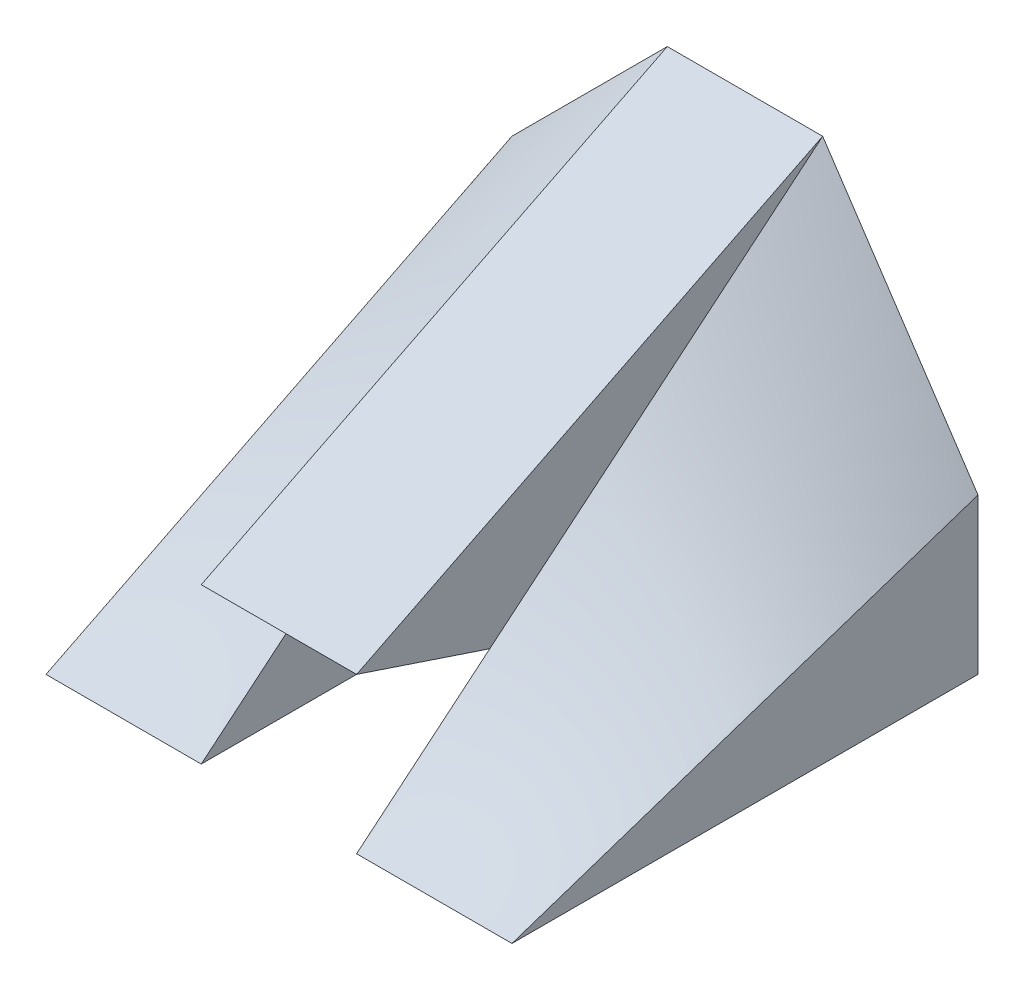
ISO-10303-21;
HEADER;
FILE_DESCRIPTION(('STEP AP214'),'2;1');
FILE_NAME('part.step','',(''),(''),'','','');
FILE_SCHEMA(('AUTOMOTIVE_DESIGN { 1 0 10303 214 1 1 1 1 }'));
ENDSEC;
DATA;
#1=APPLICATION_CONTEXT('core data for automotive mechanical design processes');
#2=APPLICATION_PROTOCOL_DEFINITION('international standard','automotive_design',2000,#1);
#3=PRODUCT_CONTEXT('',#1,'mechanical');
#4=PRODUCT('Part','Part','',(#3));
#5=PRODUCT_RELATED_PRODUCT_CATEGORY('part','',(#4));
#6=PRODUCT_DEFINITION_FORMATION('','',#4);
#7=PRODUCT_DEFINITION_CONTEXT('part definition',#1,'design');
#8=PRODUCT_DEFINITION('design','',#6,#7);
#9=PRODUCT_DEFINITION_SHAPE('','',#8);
#10=(LENGTH_UNIT() NAMED_UNIT(*) SI_UNIT(.MILLI.,.METRE.));
#11=(NAMED_UNIT(*) PLANE_ANGLE_UNIT() SI_UNIT($,.RADIAN.));
#12=(NAMED_UNIT(*) SI_UNIT($,.STERADIAN.) SOLID_ANGLE_UNIT());
#13=UNCERTAINTY_MEASURE_WITH_UNIT(LENGTH_MEASURE(1.E-05),#10,'distance_accuracy_value','');
#14=(GEOMETRIC_REPRESENTATION_CONTEXT(3) GLOBAL_UNCERTAINTY_ASSIGNED_CONTEXT((#13)) GLOBAL_UNIT_ASSIGNED_CONTEXT((#10,
#11,#12)) REPRESENTATION_CONTEXT('',''));
#15=CARTESIAN_POINT('',(0.,0.,0.));
#16=DIRECTION('',(0.,0.,1.));
#17=DIRECTION('',(1.,0.,0.));
#18=AXIS2_PLACEMENT_3D('',#15,#16,#17);
#19=CARTESIAN_POINT('',(0.,0.,0.));
#20=DIRECTION('',(0.,-1.,0.));
#21=DIRECTION('',(0.,0.,-1.));
#22=AXIS2_PLACEMENT_3D('',#19,#20,#21);
#23=PLANE('',#22);
#24=DIRECTION('',(-1.,0.,0.));
#25=VECTOR('',#24,1.);
#26=CARTESIAN_POINT('',(-3.,0.,-3.));
#27=LINE('',#26,#25);
#28=CARTESIAN_POINT('',(-1.,0.,-3.));
#29=VERTEX_POINT('',#28);
#30=CARTESIAN_POINT('',(-3.,0.,-3.));
#31=VERTEX_POINT('',#30);
#32=EDGE_CURVE('E432',#29,#31,#27,.T.);
#33=ORIENTED_EDGE('',*,*,#32,.F.);
#34=DIRECTION('',(0.,0.,-1.));
#35=VECTOR('',#34,1.);
#36=CARTESIAN_POINT('',(-1.,0.,0.));
#37=LINE('',#36,#35);
#38=CARTESIAN_POINT('',(-1.00001660641781,0.000133120669290547,3.00002214179858));
#39=VERTEX_POINT('',#38);
#40=EDGE_CURVE('E425',#39,#29,#37,.T.);
#41=ORIENTED_EDGE('',*,*,#40,.F.);
#42=CARTESIAN_POINT('',(-2.83252834775677,0.,3.));
#43=CARTESIAN_POINT('',(-2.75626208832465,0.000252161228264777,3.00016810748551));
#44=CARTESIAN_POINT('',(-2.67999555428753,0.000422557115129773,3.00028170474342));
#45=CARTESIAN_POINT('',(-2.52740270307202,0.000643858596205159,3.00042923906414));
#46=CARTESIAN_POINT('',(-2.45107638568512,0.00069467084027668,3.00046311389352));
#47=CARTESIAN_POINT('',(-2.29838560706298,0.000720595556677307,3.00048039703779));
#48=CARTESIAN_POINT('',(-2.22202114583537,0.000695670170424793,3.00046378011362));
#49=CARTESIAN_POINT('',(-2.06927384890658,0.000610254274458775,3.00040683618298));
#50=CARTESIAN_POINT('',(-1.99289101321343,0.000549755193183134,3.00036650346213));
#51=CARTESIAN_POINT('',(-1.84012317189813,0.000426265169038458,3.00028417677936));
#52=CARTESIAN_POINT('',(-1.7637381662761,0.000363274155287285,3.0002421827702));
#53=CARTESIAN_POINT('',(-1.61097685897787,0.000256806717233708,3.00017120447816));
#54=CARTESIAN_POINT('',(-1.53460055730421,0.000213328064371145,3.00014221870959));
#55=CARTESIAN_POINT('',(-1.38186052990116,0.000155320529237206,3.0001035470195));
#56=CARTESIAN_POINT('',(-1.30549680417419,0.000140786875787756,3.0000938579172));
#57=CARTESIAN_POINT('',(-1.15277716574798,0.000127346541916565,3.00008489769462));
#58=CARTESIAN_POINT('',(-1.07642125304902,0.000128438262258694,3.00008562550818));
#59=CARTESIAN_POINT('',(-1.00006534503616,0.000130688988310663,3.00008712599221));
#60=B_SPLINE_CURVE_WITH_KNOTS('',3,(#42,#43,#44,#45,#46,#47,#48,#49,#50,#51,#52,#53,#54,#55,#56,
#57,#58,#59),.UNSPECIFIED.,.F.,.F.,(4,2,2,2,2,2,2,2,4),(0.,0.228800358352873,0.457779265129282,
0.686872649245776,0.916021256563631,1.14517638662587,1.37430533758835,1.60339651672287,
1.83246424884899),.UNSPECIFIED.);
#61=CARTESIAN_POINT('',(-2.83252834775677,0.,3.));
#62=VERTEX_POINT('',#61);
#63=EDGE_CURVE('E92',#62,#39,#60,.T.);
#64=ORIENTED_EDGE('',*,*,#63,.F.);
#65=CARTESIAN_POINT('',(-2.99965424200545,-0.000691515989107811,2.9995389893406));
#66=CARTESIAN_POINT('',(-2.99269332261338,-0.00065659485866898,2.99956227009422));
#67=CARTESIAN_POINT('',(-2.98573239739642,-0.000622479066639647,2.99958501395558));
#68=CARTESIAN_POINT('',(-2.97180975850071,-0.000555824233670172,2.99962945051089));
#69=CARTESIAN_POINT('',(-2.96484804482073,-0.000523285369277587,2.99965114308715));
#70=CARTESIAN_POINT('',(-2.95092384386102,-0.000459754770680128,2.99969349681955));
#71=CARTESIAN_POINT('',(-2.94396135658016,-0.000428763206516596,2.99971415786232));
#72=CARTESIAN_POINT('',(-2.93003562348889,-0.000368297042639115,2.99975446863824));
#73=CARTESIAN_POINT('',(-2.92307237767745,-0.000338822606472967,2.99977411826236));
#74=CARTESIAN_POINT('',(-2.90914514279987,-0.000281360159494392,2.99981242656034));
#75=CARTESIAN_POINT('',(-2.90218115373281,-0.000253372305776147,2.99983108512948));
#76=CARTESIAN_POINT('',(-2.88825244780772,-0.000198852091333291,2.99986743193911));
#77=CARTESIAN_POINT('',(-2.88128773094885,-0.000172319881295047,2.99988512007914));
#78=CARTESIAN_POINT('',(-2.8673575850832,-0.000120679689118446,2.99991954687393));
#79=CARTESIAN_POINT('',(-2.86039215607564,-9.5571851318476E-05,2.99993628543246));
#80=CARTESIAN_POINT('',(-2.84646060171308,-4.67487354780505E-05,2.99996883417635));
#81=CARTESIAN_POINT('',(-2.83949447635738,-2.30335954882306E-05,2.99998464426968));
#82=CARTESIAN_POINT('',(-2.83252834775677,0.,3.));
#83=B_SPLINE_CURVE_WITH_KNOTS('',3,(#65,#66,#67,#68,#69,#70,#71,#72,#73,#74,#75,#76,#77,#78,#79,
#80,#81,#82),.UNSPECIFIED.,.F.,.F.,(4,2,2,2,2,2,2,2,4),(0.,0.0208831376683841,
0.0417686079674516,0.0626563684563951,0.083546375969528,0.104438586654167,0.125332956008622,
0.146229438920243,0.167127989703535),.UNSPECIFIED.);
#84=CARTESIAN_POINT('',(-2.99991102533979,-0.000177949320414793,2.99898778072392));
#85=VERTEX_POINT('',#84);
#86=EDGE_CURVE('E197',#85,#62,#83,.T.);
#87=ORIENTED_EDGE('',*,*,#86,.F.);
#88=DIRECTION('',(0.,0.,1.));
#89=VECTOR('',#88,1.);
#90=CARTESIAN_POINT('',(-3.,0.,3.));
#91=LINE('',#90,#89);
#92=EDGE_CURVE('E198',#31,#85,#91,.T.);
#93=ORIENTED_EDGE('',*,*,#92,.F.);
#94=EDGE_LOOP('',(#33,#41,#64,#87,#93));
#95=FACE_BOUND('',#94,.T.);
#96=ADVANCED_FACE('F51',(#95),#23,.T.);
#97=CARTESIAN_POINT('',(3.,5.,3.));
#98=DIRECTION('',(-1.,0.,0.));
#99=DIRECTION('',(0.,0.,1.));
#100=AXIS2_PLACEMENT_3D('',#97,#98,#99);
#101=PLANE('',#100);
#102=DIRECTION('',(0.,-1.,0.));
#103=VECTOR('',#102,1.);
#104=CARTESIAN_POINT('',(3.,5.,-3.));
#105=LINE('',#104,#103);
#106=CARTESIAN_POINT('',(3.,2.00039813631355,-3.));
#107=VERTEX_POINT('',#106);
#108=CARTESIAN_POINT('',(3.,0.,-3.));
#109=VERTEX_POINT('',#108);
#110=EDGE_CURVE('E12',#107,#109,#105,.T.);
#111=ORIENTED_EDGE('',*,*,#110,.F.);
#112=CARTESIAN_POINT('',(2.99949686879704,-0.000670841603944508,2.99960867573104));
#113=CARTESIAN_POINT('',(3.00010084139898,0.0835000211606389,2.74998173431321));
#114=CARTESIAN_POINT('',(3.00030915949056,0.167103942046916,2.50016526920305));
#115=CARTESIAN_POINT('',(3.00036652618134,0.333832763962334,2.0002528887572));
#116=CARTESIAN_POINT('',(3.00021542038893,0.416957443758085,1.75015689947287));
#117=CARTESIAN_POINT('',(2.99998620313517,0.583310919385398,1.25000132348962));
#118=CARTESIAN_POINT('',(2.99990809126368,0.666539714629319,0.999941736594054));
#119=CARTESIAN_POINT('',(2.99984749666387,0.833126337773783,0.499892359628227));
#120=CARTESIAN_POINT('',(2.99986500468197,0.916484152408026,0.249902565145329));
#121=CARTESIAN_POINT('',(2.99992780060308,1.08323695493404,-0.250055817476298));
#122=CARTESIAN_POINT('',(2.99997308762834,1.16663194156808,-0.500024406035495));
#123=CARTESIAN_POINT('',(3.0000150378546,1.33335583434716,-0.999995655513934));
#124=CARTESIAN_POINT('',(3.00001169894991,1.41668473747427,-1.24999831743989));
#125=CARTESIAN_POINT('',(2.99995510870599,1.5832728760559,-1.75003310879462));
#126=CARTESIAN_POINT('',(2.99990185624671,1.66653210990509,-2.00006523875875));
#127=CARTESIAN_POINT('',(2.9999314871799,1.83323209580157,-2.50002362643407));
#128=CARTESIAN_POINT('',(3.00001434838104,1.91667281604529,-2.7499498947598));
#129=CARTESIAN_POINT('',(3.00025823719015,2.00034431625353,-2.99979914885211));
#130=B_SPLINE_CURVE_WITH_KNOTS('',3,(#112,#113,#114,#115,#116,#117,#118,#119,#120,#121,#122,
#123,#124,#125,#126,#127,#128,#129),.UNSPECIFIED.,.F.,.F.,(4,2,2,2,2,2,2,2,4),(0.,
0.790304946466063,1.58094943209917,2.37158947517746,3.16215300573728,3.9526915580468,
4.74326434372514,5.53385487027832,6.32431651546668),.UNSPECIFIED.);
#131=CARTESIAN_POINT('',(2.99987421719926,-0.000167710400986034,2.99930478184289));
#132=VERTEX_POINT('',#131);
#133=EDGE_CURVE('E158',#107,#132,#130,.F.);
#134=ORIENTED_EDGE('',*,*,#133,.T.);
#135=DIRECTION('',(0.,0.,-1.));
#136=VECTOR('',#135,1.);
#137=CARTESIAN_POINT('',(3.,0.,3.));
#138=LINE('',#137,#136);
#139=EDGE_CURVE('E182',#132,#109,#138,.T.);
#140=ORIENTED_EDGE('',*,*,#139,.T.);
#141=EDGE_LOOP('',(#111,#134,#140));
#142=FACE_BOUND('',#141,.T.);
#143=ADVANCED_FACE('F53',(#142),#101,.F.);
#144=CARTESIAN_POINT('',(-3.,5.,-3.));
#145=DIRECTION('',(0.,0.,1.));
#146=DIRECTION('',(1.,0.,0.));
#147=AXIS2_PLACEMENT_3D('',#144,#145,#146);
#148=PLANE('',#147);
#149=DIRECTION('',(1.,0.,0.));
#150=VECTOR('',#149,1.);
#151=CARTESIAN_POINT('',(-1.,5.,-3.));
#152=LINE('',#151,#150);
#153=CARTESIAN_POINT('',(-1.00000045709793,5.00000091419586,-2.9999993905361));
#154=VERTEX_POINT('',#153);
#155=CARTESIAN_POINT('',(0.999905739950611,5.,-3.00017009046385));
#156=VERTEX_POINT('',#155);
#157=EDGE_CURVE('E171',#154,#156,#152,.T.);
#158=ORIENTED_EDGE('',*,*,#157,.T.);
#159=CARTESIAN_POINT('',(3.00025823719015,2.00034431625353,-2.99979914885211));
#160=CARTESIAN_POINT('',(2.9165815343091,2.12500950582586,-3.00003244505779));
#161=CARTESIAN_POINT('',(2.8331245400502,2.24982154317101,-3.00013496185396));
#162=CARTESIAN_POINT('',(2.6663872700847,2.49968129762726,-3.00020253257725));
#163=CARTESIAN_POINT('',(2.58310714493294,2.62472911530675,-3.0001674969042));
#164=CARTESIAN_POINT('',(2.41655849866416,2.87485598742635,-3.0000840726291));
#165=CARTESIAN_POINT('',(2.33328998049428,2.99993504381261,-3.00003568227929));
#166=CARTESIAN_POINT('',(2.1667171902848,3.25005273534464,-2.99996471978813));
#167=CARTESIAN_POINT('',(2.0834129222521,3.37509137315484,-2.99994214526546));
#168=CARTESIAN_POINT('',(1.91676891665385,3.62512523974865,-2.99992351752527));
#169=CARTESIAN_POINT('',(1.83342918396722,3.75012047178516,-2.99992746140581));
#170=CARTESIAN_POINT('',(1.6667419817785,4.00009936226447,-2.9999417119794));
#171=CARTESIAN_POINT('',(1.58339451265636,4.12508302096064,-2.99995201844643));
#172=CARTESIAN_POINT('',(1.4167112859051,4.3750584961942,-2.99996556959362));
#173=CARTESIAN_POINT('',(1.33337552829874,4.50005031274676,-2.99996881426025));
#174=CARTESIAN_POINT('',(1.16667899081956,4.75000058621244,-2.99999476442776));
#175=CARTESIAN_POINT('',(1.0833182139662,4.87495904513981,-3.00001746813241));
#176=CARTESIAN_POINT('',(0.999918795167255,4.99989172688968,-3.00006315931436));
#177=B_SPLINE_CURVE_WITH_KNOTS('',3,(#159,#160,#161,#162,#163,#164,#165,#166,#167,#168,#169,
#170,#171,#172,#173,#174,#175,#176),.UNSPECIFIED.,.F.,.F.,(4,2,2,2,2,2,2,2,4),(0.,
0.450431095663525,0.901155645919849,1.35193921195104,1.80268119325227,2.25337385039558,
2.70405049890196,3.15472801094315,3.60536392622476),.UNSPECIFIED.);
#178=EDGE_CURVE('E151',#156,#107,#177,.F.);
#179=ORIENTED_EDGE('',*,*,#178,.T.);
#180=ORIENTED_EDGE('',*,*,#110,.T.);
#181=CARTESIAN_POINT('',(1.,0.,-3.));
#182=VERTEX_POINT('',#181);
#183=EDGE_CURVE('E203',#109,#182,#27,.T.);
#184=ORIENTED_EDGE('',*,*,#183,.T.);
#185=DIRECTION('',(1.,0.,0.));
#186=VECTOR('',#185,1.);
#187=CARTESIAN_POINT('',(-1.,0.,-3.));
#188=LINE('',#187,#186);
#189=EDGE_CURVE('E175',#29,#182,#188,.T.);
#190=ORIENTED_EDGE('',*,*,#189,.F.);
#191=ORIENTED_EDGE('',*,*,#32,.T.);
#192=DIRECTION('',(0.,-1.,0.));
#193=VECTOR('',#192,1.);
#194=CARTESIAN_POINT('',(-3.,5.,-3.));
#195=LINE('',#194,#193);
#196=CARTESIAN_POINT('',(-3.,3.00064485905729,-3.));
#197=VERTEX_POINT('',#196);
#198=EDGE_CURVE('E63',#197,#31,#195,.T.);
#199=ORIENTED_EDGE('',*,*,#198,.F.);
#200=CARTESIAN_POINT('',(-1.00000114274482,5.00000228548965,-2.99999847634025));
#201=CARTESIAN_POINT('',(-1.08338845189845,4.91675269914589,-2.99993726620253));
#202=CARTESIAN_POINT('',(-1.16675115447005,4.83347845242652,-2.99989795249043));
#203=CARTESIAN_POINT('',(-1.33344518739327,4.66686720589872,-2.99986115853691));
#204=CARTESIAN_POINT('',(-1.41677650889303,4.58353019723219,-2.99986368616658));
#205=CARTESIAN_POINT('',(-1.58340858460542,4.4167969732732,-2.99990864094285));
#206=CARTESIAN_POINT('',(-1.66670933109036,4.33340075026015,-2.99995107495534));
#207=CARTESIAN_POINT('',(-1.83328933596971,4.16656749120476,-3.00006363236691));
#208=CARTESIAN_POINT('',(-1.91656859073512,4.08313045154217,-3.00013375898788));
#209=CARTESIAN_POINT('',(-2.08312301222705,3.91625136587081,-3.00027805417874));
#210=CARTESIAN_POINT('',(-2.16639817892828,3.83280931983681,-3.00035222277108));
#211=CARTESIAN_POINT('',(-2.33297476227846,3.66598107573997,-3.00046407199182));
#212=CARTESIAN_POINT('',(-2.41627617161399,3.58259487037883,-3.00050175911431));
#213=CARTESIAN_POINT('',(-2.5829487300113,3.41596628331295,-3.00048221630034));
#214=CARTESIAN_POINT('',(-2.66631983149623,3.33272385409654,-3.00042502862544));
#215=CARTESIAN_POINT('',(-2.83319597199074,3.16650667575041,-3.0001321565595));
#216=CARTESIAN_POINT('',(-2.91670085171446,3.08353176636899,-2.99989661418514));
#217=CARTESIAN_POINT('',(-3.0003524108194,3.00070482163879,-2.99953011890747));
#218=B_SPLINE_CURVE_WITH_KNOTS('',3,(#200,#201,#202,#203,#204,#205,#206,#207,#208,#209,#210,
#211,#212,#213,#214,#215,#216,#217),.UNSPECIFIED.,.F.,.F.,(4,2,2,2,2,2,2,2,4),(0.,
0.353490394854379,0.707047288165293,1.0606650221383,1.41432390977513,1.76798476170235,
2.12158264664126,2.47502306524455,2.82818234898998),.UNSPECIFIED.);
#219=EDGE_CURVE('E179',#154,#197,#218,.T.);
#220=ORIENTED_EDGE('',*,*,#219,.F.);
#221=EDGE_LOOP('',(#158,#179,#180,#184,#190,#191,#199,#220));
#222=FACE_BOUND('',#221,.T.);
#223=ADVANCED_FACE('F178',(#222),#148,.F.);
#224=CARTESIAN_POINT('',(-3.,5.,3.));
#225=DIRECTION('',(1.,0.,0.));
#226=DIRECTION('',(0.,0.,-1.));
#227=AXIS2_PLACEMENT_3D('',#224,#225,#226);
#228=PLANE('',#227);
#229=ORIENTED_EDGE('',*,*,#92,.T.);
#230=CARTESIAN_POINT('',(-3.0003524108194,3.00070482163879,-2.99953011890747));
#231=CARTESIAN_POINT('',(-3.00011826196853,2.87522268396966,-2.74981463744052));
#232=CARTESIAN_POINT('',(-3.00001029525953,2.75000963336516,-2.49996435867952));
#233=CARTESIAN_POINT('',(-2.99991614385439,2.49982709521279,-2.00010142320219));
#234=CARTESIAN_POINT('',(-2.99992997489533,2.37485764122577,-1.75008874967646));
#235=CARTESIAN_POINT('',(-2.99994882986483,2.12489826708271,-1.25006944155302));
#236=CARTESIAN_POINT('',(-2.99995385367352,1.99990834667128,-1.0000628070838));
#237=CARTESIAN_POINT('',(-2.9999538752773,1.74990794211043,-0.50006188274196));
#238=CARTESIAN_POINT('',(-2.99994887313902,1.62489745810321,-0.250067592798324));
#239=CARTESIAN_POINT('',(-2.99995039565112,1.37489976955842,0.249935904355791));
#240=CARTESIAN_POINT('',(-2.99995692042229,1.24991256527852,0.499945111695139));
#241=CARTESIAN_POINT('',(-2.99999281832588,0.99998477075985,0.999992156218313));
#242=CARTESIAN_POINT('',(-3.00002219184974,0.875044181356342,1.25002999381924));
#243=CARTESIAN_POINT('',(-3.00007425613638,0.62515178685525,1.75009245901683));
#244=CARTESIAN_POINT('',(-3.00009694706339,0.500199982108799,2.00011708678713));
#245=CARTESIAN_POINT('',(-3.00000810694073,0.250027924926271,2.49998738716467));
#246=CARTESIAN_POINT('',(-2.99989659500183,0.124807713246414,2.7498330801836));
#247=CARTESIAN_POINT('',(-2.99965424200545,-0.000691515989107036,2.9995389893406));
#248=B_SPLINE_CURVE_WITH_KNOTS('',3,(#230,#231,#232,#233,#234,#235,#236,#237,#238,#239,#240,
#241,#242,#243,#244,#245,#246,#247),.UNSPECIFIED.,.F.,.F.,(4,2,2,2,2,2,2,2,4),(0.,
0.838410062262009,1.67692845425153,2.51545825843106,3.35398248889736,4.19251550657209,
5.031062889859,5.86958966336629,6.70799704300412),.UNSPECIFIED.);
#249=EDGE_CURVE('E535',#197,#85,#248,.T.);
#250=ORIENTED_EDGE('',*,*,#249,.F.);
#251=ORIENTED_EDGE('',*,*,#198,.T.);
#252=EDGE_LOOP('',(#229,#250,#251));
#253=FACE_BOUND('',#252,.T.);
#254=ADVANCED_FACE('F225',(#253),#228,.F.);
#255=CARTESIAN_POINT('',(2.87364055055317,-1.30086473006368E-13,2.99999999999992));
#256=CARTESIAN_POINT('',(2.87891027117043,7.1828189650233E-06,2.99990463763288));
#257=CARTESIAN_POINT('',(2.88417998362946,1.35006861652053E-05,2.9998087585972));
#258=CARTESIAN_POINT('',(2.89471809137143,2.43797556147098E-05,2.99961597579852));
#259=CARTESIAN_POINT('',(2.89998648665866,2.89413907719398E-05,2.99951907229411));
#260=CARTESIAN_POINT('',(2.91052194200927,3.62838855908097E-05,2.99932422649281));
#261=CARTESIAN_POINT('',(2.91578900207725,3.90651900636696E-05,2.99922628446162));
#262=CARTESIAN_POINT('',(2.9263217690714,4.28231292300758E-05,2.99902934766838));
#263=CARTESIAN_POINT('',(2.93158747600251,4.38002206952734E-05,2.99893035317917));
#264=CARTESIAN_POINT('',(2.94211751895265,4.39260239194816E-05,2.99873129763887));
#265=CARTESIAN_POINT('',(2.94738185497698,4.30752044694989E-05,2.99863123686779));
#266=CARTESIAN_POINT('',(2.95790913849374,3.95216835856415E-05,2.99843003505396));
#267=CARTESIAN_POINT('',(2.96317208599182,3.68194630088456E-05,2.99832889429843));
#268=CARTESIAN_POINT('',(2.97369657499703,2.95398359042976E-05,2.99812551892135));
#269=CARTESIAN_POINT('',(2.97895811651018,2.49629223423935E-05,2.99802328459425));
#270=CARTESIAN_POINT('',(2.98947977624207,1.39108697618572E-05,2.99781770863479));
#271=CARTESIAN_POINT('',(2.99473989446724,7.43623583648157E-06,2.9977143673041));
#272=CARTESIAN_POINT('',(3.,0.,2.99761045164054));
#273=B_SPLINE_CURVE_WITH_KNOTS('',3,(#255,#256,#257,#258,#259,#260,#261,#262,#263,#264,#265,
#266,#267,#268,#269,#270,#271,#272),.UNSPECIFIED.,.F.,.F.,(4,2,2,2,2,2,2,2,4),(0.,
0.0158117648022484,0.031619629534852,0.047423543168345,0.0632234551845325,0.079019315596014,
0.0948110749657134,0.11059868442637,0.126382095699962),.UNSPECIFIED.);
#274=CARTESIAN_POINT('',(2.87364055055317,0.,2.99999999999996));
#275=VERTEX_POINT('',#274);
#276=EDGE_CURVE('E289',#275,#132,#273,.T.);
#277=ORIENTED_EDGE('',*,*,#276,.F.);
#278=CARTESIAN_POINT('',(1.98327212168256,0.,3.));
#279=CARTESIAN_POINT('',(2.02042211919781,6.72781461168678E-05,3.00003924558524));
#280=CARTESIAN_POINT('',(2.057572111324,0.000136984605077867,3.0000799076863));
#281=CARTESIAN_POINT('',(2.13186991958987,0.000273495808330301,3.00015953922153));
#282=CARTESIAN_POINT('',(2.16901773572914,0.000340300722889973,3.00019850875502));
#283=CARTESIAN_POINT('',(2.24330529407859,0.000463246822863635,3.00027022731334));
#284=CARTESIAN_POINT('',(2.28044503628338,0.000519390329932573,3.00030297769246));
#285=CARTESIAN_POINT('',(2.35471019993478,0.000612626142159745,3.0003573652496));
#286=CARTESIAN_POINT('',(2.3918356213683,0.000649725802299114,3.00037900671801));
#287=CARTESIAN_POINT('',(2.46606563964197,0.000696180830378228,3.00040610548439));
#288=CARTESIAN_POINT('',(2.50317023646731,0.000705551768813412,3.00041157186514));
#289=CARTESIAN_POINT('',(2.57735193841034,0.000687626350571504,3.00040111537117));
#290=CARTESIAN_POINT('',(2.61442904353435,0.000660357148033794,3.00038520833635));
#291=CARTESIAN_POINT('',(2.68854903562777,0.000560135952912417,3.00032674597253));
#292=CARTESIAN_POINT('',(2.72559192266662,0.000487226050810395,3.00028421519631));
#293=CARTESIAN_POINT('',(2.79963677767499,0.000286782755093509,3.00016728994047));
#294=CARTESIAN_POINT('',(2.83663874586596,0.000159309491791266,3.00009293053688));
#295=CARTESIAN_POINT('',(2.87364055055317,-1.30999574523508E-13,2.99999999999992));
#296=B_SPLINE_CURVE_WITH_KNOTS('',3,(#278,#279,#280,#281,#282,#283,#284,#285,#286,#287,#288,
#289,#290,#291,#292,#293,#294,#295),.UNSPECIFIED.,.F.,.F.,(4,2,2,2,2,2,2,2,4),(0.,
0.111450238557753,0.222893928139223,0.334313321562456,0.445689650930331,0.557003427323282,
0.668234754163489,0.779363652758086,0.890370398309035),.UNSPECIFIED.);
#297=CARTESIAN_POINT('',(1.98327212168256,0.,3.));
#298=VERTEX_POINT('',#297);
#299=EDGE_CURVE('E285',#298,#275,#296,.T.);
#300=ORIENTED_EDGE('',*,*,#299,.F.);
#301=CARTESIAN_POINT('',(1.14556010496011,0.,3.));
#302=CARTESIAN_POINT('',(1.18040396579942,-9.46376746775268E-05,2.99994479468978));
#303=CARTESIAN_POINT('',(1.2152478760174,-0.000175562311507746,2.99989758865163));
#304=CARTESIAN_POINT('',(1.28495583742289,-0.000310572245748916,2.99981883285665));
#305=CARTESIAN_POINT('',(1.31981988865065,-0.000364642056086445,2.99978729213395));
#306=CARTESIAN_POINT('',(1.38956759999862,-0.000446444249400181,2.99973957418786));
#307=CARTESIAN_POINT('',(1.42445126014186,-0.000474161833141911,2.99972340559734));
#308=CARTESIAN_POINT('',(1.49423693165626,-0.000505003625844228,2.9997054145516));
#309=CARTESIAN_POINT('',(1.52913894303473,-0.000508114899107588,2.99970359964219));
#310=CARTESIAN_POINT('',(1.59895938131959,-0.000492315213259961,2.9997128161256));
#311=CARTESIAN_POINT('',(1.63387780822243,-0.00047339389093427,2.99972385356363));
#312=CARTESIAN_POINT('',(1.70372851312913,-0.000416970266194415,2.99975676734473));
#313=CARTESIAN_POINT('',(1.73866079112467,-0.000379460585094694,2.99977864799203));
#314=CARTESIAN_POINT('',(1.80853605615959,-0.00029002244878484,2.99983082023821));
#315=CARTESIAN_POINT('',(1.84347904319103,-0.000238089566155086,2.99986111441975));
#316=CARTESIAN_POINT('',(1.91337206309833,-0.00012483073467766,2.99992718207144));
#317=CARTESIAN_POINT('',(1.94832209597014,-6.35028885550932E-05,2.99996295664835));
#318=CARTESIAN_POINT('',(1.98327212168256,0.,3.));
#319=B_SPLINE_CURVE_WITH_KNOTS('',3,(#301,#302,#303,#304,#305,#306,#307,#308,#309,#310,#311,
#312,#313,#314,#315,#316,#317,#318),.UNSPECIFIED.,.F.,.F.,(4,2,2,2,2,2,2,2,4),(0.,
0.10453209491258,0.209124403281236,0.313775415355975,0.418481439492868,0.523236732880033,
0.62803364243547,0.732862756608992,0.837713068573577),.UNSPECIFIED.);
#320=CARTESIAN_POINT('',(1.14556010496011,0.,3.));
#321=VERTEX_POINT('',#320);
#322=EDGE_CURVE('E287',#321,#298,#319,.T.);
#323=ORIENTED_EDGE('',*,*,#322,.F.);
#324=CARTESIAN_POINT('',(1.00035198139916,0.00046930773455586,3.00027376284516));
#325=CARTESIAN_POINT('',(1.00640030301868,0.000446695200143714,3.00026057220009));
#326=CARTESIAN_POINT('',(1.01244862649176,0.000424452171438616,3.00024759710001));
#327=CARTESIAN_POINT('',(1.02454583454129,0.000380714182631896,3.00022208327321));
#328=CARTESIAN_POINT('',(1.03059471911806,0.000359219291668065,3.00020954458681));
#329=CARTESIAN_POINT('',(1.0426930576526,0.0003169888329314,3.00018491015255));
#330=CARTESIAN_POINT('',(1.04874251161071,0.000296253336374448,3.00017281444622));
#331=CARTESIAN_POINT('',(1.0608419964039,0.000255551597607364,3.00014907176528));
#332=CARTESIAN_POINT('',(1.06689202723932,0.000235585428497542,3.00013742483329));
#333=CARTESIAN_POINT('',(1.0789926725114,0.000196431327121632,3.00011458494083));
#334=CARTESIAN_POINT('',(1.08504328694838,0.000177243469674597,3.00010339202398));
#335=CARTESIAN_POINT('',(1.09714510538122,0.000139653912877052,3.00008146478252));
#336=CARTESIAN_POINT('',(1.1031963093774,0.000121252289881952,3.00007073050244));
#337=CARTESIAN_POINT('',(1.11529931212679,8.52421875790955E-05,3.00004972460943));
#338=CARTESIAN_POINT('',(1.12135111088032,6.76337859876732E-05,3.00003945304183));
#339=CARTESIAN_POINT('',(1.13345530758722,3.32158371734425E-05,3.00001937590502));
#340=CARTESIAN_POINT('',(1.13950770554088,1.64063688148268E-05,3.00000957038181));
#341=CARTESIAN_POINT('',(1.14556010496011,0.,3.));
#342=B_SPLINE_CURVE_WITH_KNOTS('',3,(#324,#325,#326,#327,#328,#329,#330,#331,#332,#333,#334,
#335,#336,#337,#338,#339,#340,#341),.UNSPECIFIED.,.F.,.F.,(4,2,2,2,2,2,2,2,4),(0.,
0.0181451348067988,0.0362919420348874,0.0544404467323786,0.0725906716416534,0.0907426372158969,
0.108896361635779,0.127051860826279,0.145209148473664),.UNSPECIFIED.);
#343=CARTESIAN_POINT('',(1.00009245775377,0.000454796367792969,3.00007191152515));
#344=VERTEX_POINT('',#343);
#345=EDGE_CURVE('E292',#344,#321,#342,.T.);
#346=ORIENTED_EDGE('',*,*,#345,.F.);
#347=DIRECTION('',(0.,0.,-1.));
#348=VECTOR('',#347,1.);
#349=CARTESIAN_POINT('',(1.,0.,0.));
#350=LINE('',#349,#348);
#351=EDGE_CURVE('E439',#344,#182,#350,.T.);
#352=ORIENTED_EDGE('',*,*,#351,.T.);
#353=ORIENTED_EDGE('',*,*,#183,.F.);
#354=ORIENTED_EDGE('',*,*,#139,.F.);
#355=EDGE_LOOP('',(#277,#300,#323,#346,#352,#353,#354));
#356=FACE_BOUND('',#355,.T.);
#357=ADVANCED_FACE('F246',(#356),#23,.T.);
#358=CARTESIAN_POINT('',(-1.,2.8,1.4));
#359=DIRECTION('',(0.,0.894427190999916,0.447213595499958));
#360=DIRECTION('',(0.,-0.447213595499958,0.894427190999916));
#361=AXIS2_PLACEMENT_3D('',#358,#359,#360);
#362=PLANE('',#361);
#363=DIRECTION('',(0.,-0.447213595499958,0.894427190999916));
#364=VECTOR('',#363,1.);
#365=CARTESIAN_POINT('',(1.,2.8,1.4));
#366=LINE('',#365,#364);
#367=CARTESIAN_POINT('',(1.,2.,3.));
#368=VERTEX_POINT('',#367);
#369=EDGE_CURVE('E147',#156,#368,#366,.T.);
#370=ORIENTED_EDGE('',*,*,#369,.F.);
#371=ORIENTED_EDGE('',*,*,#157,.F.);
#372=DIRECTION('',(0.,-0.447213595499958,0.894427190999916));
#373=VECTOR('',#372,1.);
#374=CARTESIAN_POINT('',(-1.,2.8,1.4));
#375=LINE('',#374,#373);
#376=CARTESIAN_POINT('',(-1.,2.,3.));
#377=VERTEX_POINT('',#376);
#378=EDGE_CURVE('E174',#154,#377,#375,.T.);
#379=ORIENTED_EDGE('',*,*,#378,.T.);
#380=DIRECTION('',(1.,0.,0.));
#381=VECTOR('',#380,1.);
#382=CARTESIAN_POINT('',(-1.,2.,3.));
#383=LINE('',#382,#381);
#384=EDGE_CURVE('E173',#377,#368,#383,.T.);
#385=ORIENTED_EDGE('',*,*,#384,.T.);
#386=EDGE_LOOP('',(#370,#371,#379,#385));
#387=FACE_BOUND('',#386,.T.);
#388=ADVANCED_FACE('F169',(#387),#362,.T.);
#389=CARTESIAN_POINT('',(-1.,0.9,-0.3));
#390=DIRECTION('',(0.,-0.948683298050514,0.316227766016838));
#391=DIRECTION('',(0.,-0.316227766016838,-0.948683298050514));
#392=AXIS2_PLACEMENT_3D('',#389,#390,#391);
#393=PLANE('',#392);
#394=DIRECTION('',(0.,-0.316227766016838,-0.948683298050514));
#395=VECTOR('',#394,1.);
#396=CARTESIAN_POINT('',(1.,0.9,-0.3));
#397=LINE('',#396,#395);
#398=CARTESIAN_POINT('',(1.,1.42857561303269,1.28572683909806));
#399=VERTEX_POINT('',#398);
#400=EDGE_CURVE('E149',#368,#399,#397,.T.);
#401=ORIENTED_EDGE('',*,*,#400,.F.);
#402=ORIENTED_EDGE('',*,*,#384,.F.);
#403=DIRECTION('',(0.,-0.316227766016838,-0.948683298050514));
#404=VECTOR('',#403,1.);
#405=CARTESIAN_POINT('',(-1.,0.9,-0.3));
#406=LINE('',#405,#404);
#407=CARTESIAN_POINT('',(-1.00002115307454,1.42858826518237,1.28577305325942));
#408=VERTEX_POINT('',#407);
#409=EDGE_CURVE('E422',#377,#408,#406,.T.);
#410=ORIENTED_EDGE('',*,*,#409,.T.);
#411=EDGE_CURVE('E206',#408,#29,#406,.T.);
#412=ORIENTED_EDGE('',*,*,#411,.T.);
#413=ORIENTED_EDGE('',*,*,#189,.T.);
#414=EDGE_CURVE('E103',#399,#182,#397,.T.);
#415=ORIENTED_EDGE('',*,*,#414,.F.);
#416=EDGE_LOOP('',(#401,#402,#410,#412,#413,#415));
#417=FACE_BOUND('',#416,.T.);
#418=ADVANCED_FACE('F438',(#417),#393,.T.);
#419=CARTESIAN_POINT('',(-1.,0.,0.));
#420=DIRECTION('',(1.,0.,0.));
#421=DIRECTION('',(0.,0.,-1.));
#422=AXIS2_PLACEMENT_3D('',#419,#420,#421);
#423=PLANE('',#422);
#424=CARTESIAN_POINT('',(-1.00006534449415,0.000130688988303141,3.0000871259922));
#425=CARTESIAN_POINT('',(-1.00003474759407,0.0595931808241332,2.92861790736224));
#426=CARTESIAN_POINT('',(-1.00001127877507,0.119068768614622,2.85715958508938));
#427=CARTESIAN_POINT('',(-0.999975696431297,0.238042654834404,2.71425808087556));
#428=CARTESIAN_POINT('',(-0.999963583259881,0.297540953912775,2.64281489947489));
#429=CARTESIAN_POINT('',(-0.999947812701628,0.416554475266865,2.49993979709918));
#430=CARTESIAN_POINT('',(-0.999944155513022,0.476069697906605,2.42850787642735));
#431=CARTESIAN_POINT('',(-0.999942849231397,0.595112167778816,2.28565203579597));
#432=CARTESIAN_POINT('',(-0.999945200238644,0.65463941519538,2.21422811598982));
#433=CARTESIAN_POINT('',(-0.999953778777175,0.773701672310355,2.07138543399569));
#434=CARTESIAN_POINT('',(-0.999960006350506,0.833236682085958,1.99996667187207));
#435=CARTESIAN_POINT('',(-0.999974550560834,0.952310887784249,1.85713192341935));
#436=CARTESIAN_POINT('',(-0.999982867210158,1.01185008372957,1.78571593710911));
#437=CARTESIAN_POINT('',(-1.00000009763413,1.13092968024564,1.64288474820596));
#438=CARTESIAN_POINT('',(-1.00000901140986,1.1904700808184,1.57146954561472));
#439=CARTESIAN_POINT('',(-1.00002632350514,1.30954985105181,1.42863845315703));
#440=CARTESIAN_POINT('',(-1.00003472182543,1.36908922071381,1.35722256329171));
#441=CARTESIAN_POINT('',(-1.00004230614907,1.42862709614999,1.28580542757655));
#442=B_SPLINE_CURVE_WITH_KNOTS('',3,(#424,#425,#426,#427,#428,#429,#430,#431,#432,#433,#434,
#435,#436,#437,#438,#439,#440,#441),.UNSPECIFIED.,.F.,.F.,(4,2,2,2,2,2,2,2,4),(0.,
0.278913498324395,0.557835675317651,0.836764390897712,1.11569776125807,1.39463415713675,
1.67357219897757,1.9525107493193,2.2314489027322),.UNSPECIFIED.);
#443=EDGE_CURVE('E401',#39,#408,#442,.T.);
#444=ORIENTED_EDGE('',*,*,#443,.F.);
#445=ORIENTED_EDGE('',*,*,#40,.T.);
#446=ORIENTED_EDGE('',*,*,#411,.F.);
#447=EDGE_LOOP('',(#444,#445,#446));
#448=FACE_BOUND('',#447,.T.);
#449=ADVANCED_FACE('F376',(#448),#423,.T.);
#450=CARTESIAN_POINT('',(1.,0.,0.));
#451=DIRECTION('',(1.,0.,0.));
#452=DIRECTION('',(0.,0.,-1.));
#453=AXIS2_PLACEMENT_3D('',#450,#451,#452);
#454=PLANE('',#453);
#455=ORIENTED_EDGE('',*,*,#351,.F.);
#456=CARTESIAN_POINT('',(1.00001182368569,1.42858079150769,1.28573116428787));
#457=CARTESIAN_POINT('',(0.999984602175363,1.36902075676607,1.35713847927548));
#458=CARTESIAN_POINT('',(0.999955431980088,1.30945844446588,1.42854389379361));
#459=CARTESIAN_POINT('',(0.999897717691961,1.1903346546679,1.57135520979941));
#460=CARTESIAN_POINT('',(0.999869173598025,1.13077317716885,1.64276111128602));
#461=CARTESIAN_POINT('',(0.999817235243085,1.01165712076087,1.7855768811094));
#462=CARTESIAN_POINT('',(0.999793840905987,0.952102541763004,1.85698674937197));
#463=CARTESIAN_POINT('',(0.999757909785724,0.833007880716253,1.99981490640878));
#464=CARTESIAN_POINT('',(0.999745372673341,0.773467798282533,2.07123319486202));
#465=CARTESIAN_POINT('',(0.999737629318688,0.654410760308295,2.21408322845449));
#466=CARTESIAN_POINT('',(0.999742422242969,0.594893803793262,2.28551497278137));
#467=CARTESIAN_POINT('',(0.999776565240852,0.475892647207537,2.42839754514587));
#468=CARTESIAN_POINT('',(0.999805913651413,0.416408445191514,2.49984837156355));
#469=CARTESIAN_POINT('',(0.999896965898908,0.297483191449426,2.64277517806476));
#470=CARTESIAN_POINT('',(0.999958666863515,0.238042136361749,2.71425115535249));
#471=CARTESIAN_POINT('',(1.00012274198121,0.119214256301585,2.85723474559342));
#472=CARTESIAN_POINT('',(1.00022511163014,0.0598274260533529,2.92874235416764));
#473=CARTESIAN_POINT('',(1.00035198080259,0.000469307736787345,3.00027376284646));
#474=B_SPLINE_CURVE_WITH_KNOTS('',3,(#456,#457,#458,#459,#460,#461,#462,#463,#464,#465,#466,
#467,#468,#469,#470,#471,#472,#473),.UNSPECIFIED.,.F.,.F.,(4,2,2,2,2,2,2,2,4),(0.,
0.278958111607751,0.557915740351143,0.836869246933236,1.11581429468095,1.39474592736321,
1.67365867070065,1.95254665578128,2.23140376190899),.UNSPECIFIED.);
#475=EDGE_CURVE('E150',#344,#399,#474,.F.);
#476=ORIENTED_EDGE('',*,*,#475,.T.);
#477=ORIENTED_EDGE('',*,*,#414,.T.);
#478=EDGE_LOOP('',(#455,#476,#477));
#479=FACE_BOUND('',#478,.T.);
#480=ADVANCED_FACE('F375',(#479),#454,.F.);
#481=CARTESIAN_POINT('',(-0.980807885658504,5.06235288270912,-3.0516026269956));
#482=CARTESIAN_POINT('',(-1.39118437789236,4.80619001447137,-3.23863804642564));
#483=CARTESIAN_POINT('',(-1.79400164294036,4.5349086918619,-3.43575243543682));
#484=CARTESIAN_POINT('',(-2.18891840580203,4.24782636487977,-3.64340082736312));
#485=CARTESIAN_POINT('',(-2.57438044462675,3.94183458982375,-3.86365551800534));
#486=CARTESIAN_POINT('',(-2.95120288143674,3.61856361073826,-4.09542967800053));
#487=CARTESIAN_POINT('',(-0.961208840181941,4.04503357206255,-1.81286253126782));
#488=CARTESIAN_POINT('',(-1.39105169029771,3.82780341958863,-1.97394280685533));
#489=CARTESIAN_POINT('',(-1.81305086346918,3.5948859132261,-2.14548131836857));
#490=CARTESIAN_POINT('',(-2.22783751942112,3.34754337242454,-2.32663651950782));
#491=CARTESIAN_POINT('',(-2.63333018645779,3.08161285379241,-2.52018370586747));
#492=CARTESIAN_POINT('',(-3.03042452593157,2.79888568003452,-2.72492866231095));
#493=CARTESIAN_POINT('',(-0.939432570247619,3.02335981250045,-0.577025401483806));
#494=CARTESIAN_POINT('',(-1.39054615616659,2.84867113163293,-0.709744696000352));
#495=CARTESIAN_POINT('',(-1.83639296555857,2.66344889771142,-0.849486359219554));
#496=CARTESIAN_POINT('',(-2.27539559651051,2.46453830690983,-0.998353593692156));
#497=CARTESIAN_POINT('',(-2.70961769157178,2.25606664432691,-1.15359487601896));
#498=CARTESIAN_POINT('',(-3.13767127908318,2.03525796664423,-1.31706083507893));
#499=CARTESIAN_POINT('',(-0.91660914900542,1.99959175032261,0.657415526556505));
#500=CARTESIAN_POINT('',(-1.39180468998151,1.87306697956933,0.556805505449423));
#501=CARTESIAN_POINT('',(-1.86195735565579,1.73645645821243,0.449471650606598));
#502=CARTESIAN_POINT('',(-2.32980487562864,1.59523564545266,0.339064268161875));
#503=CARTESIAN_POINT('',(-2.79279976758064,1.4443095766512,0.222186715022672));
#504=CARTESIAN_POINT('',(-3.2518354240068,1.28546503679808,0.100030181182366));
#505=CARTESIAN_POINT('',(-0.886183453478095,0.960619139574514,1.88172008888318));
#506=CARTESIAN_POINT('',(-1.39370591122731,0.898748202367474,1.82421262347362));
#507=CARTESIAN_POINT('',(-1.89991659630925,0.834253719825889,1.76495612784102));
#508=CARTESIAN_POINT('',(-2.40182897302347,0.76116262054888,1.69996855438481));
#509=CARTESIAN_POINT('',(-2.9013387250872,0.683266271970871,1.6317774813946));
#510=CARTESIAN_POINT('',(-3.39813566272698,0.599944294544965,1.55996932250578));
#511=CARTESIAN_POINT('',(-0.851787187273692,-0.0862946125277376,3.10073055697384));
#512=CARTESIAN_POINT('',(-1.39791905760005,-0.0709467245804852,3.09470230833379));
#513=CARTESIAN_POINT('',(-1.94280265887257,-0.0580953747409092,3.08700970095529));
#514=CARTESIAN_POINT('',(-2.48920674346407,-0.0422030582633672,3.08134440466878));
#515=CARTESIAN_POINT('',(-3.03229752725485,-0.0329373433872593,3.07126137398131));
#516=CARTESIAN_POINT('',(-3.57176797890783,-0.0309122927867722,3.05635123377675));
#517=B_SPLINE_SURFACE_WITH_KNOTS('',5,5,((#481,#482,#483,#484,#485,#486),(#487,#488,#489,#490,
#491,#492),(#493,#494,#495,#496,#497,#498),(#499,#500,#501,#502,#503,#504),(#505,#506,#507,#508,
#509,#510),(#511,#512,#513,#514,#515,#516)),.UNSPECIFIED.,.F.,.F.,.F.,(6,6),(6,6),
(-4.2705250345026,3.7073931831088),(-1.1545908145897,1.34940178126503),.UNSPECIFIED.);
#518=CARTESIAN_POINT('',(-1.00004230614907,1.42862709614999,1.28580542757655));
#519=CARTESIAN_POINT('',(-1.00006289990274,1.57747777984046,1.10726149049502));
#520=CARTESIAN_POINT('',(-1.00007600745971,1.72631472143861,0.928706095456572));
#521=CARTESIAN_POINT('',(-1.00008709941932,2.0239583583678,0.571575141124093));
#522=CARTESIAN_POINT('',(-1.00008508407406,2.17276505416168,0.392999582215815));
#523=CARTESIAN_POINT('',(-1.00006578031291,2.47034811918322,0.035827836814985));
#524=CARTESIAN_POINT('',(-1.00004849213114,2.61912448884081,-0.142768349319394));
#525=CARTESIAN_POINT('',(-1.00000655338441,2.91666257042344,-0.499970618539658));
#526=CARTESIAN_POINT('',(-0.999981902875692,3.06542428245176,-0.678576701539536));
#527=CARTESIAN_POINT('',(-0.999935634180895,3.36295376631966,-1.03578481864158));
#528=CARTESIAN_POINT('',(-0.99991401600482,3.5117215381776,-1.21438685272846));
#529=CARTESIAN_POINT('',(-0.999884019241538,3.80928348546322,-1.57157317738745));
#530=CARTESIAN_POINT('',(-0.999875640840305,3.95807766123242,-1.7501574676751));
#531=CARTESIAN_POINT('',(-0.999879512123176,4.25570698652853,-2.10729820524104));
#532=CARTESIAN_POINT('',(-0.999891762236996,4.40454213684441,-2.28585465186183));
#533=CARTESIAN_POINT('',(-0.999933935956666,4.70224778451223,-2.64294398050978));
#534=CARTESIAN_POINT('',(-0.99996385990741,4.85111828249728,-2.82147686200908));
#535=CARTESIAN_POINT('',(-1.00000114274482,5.00000228548965,-2.99999847634025));
#536=B_SPLINE_CURVE_WITH_KNOTS('',3,(#518,#519,#520,#521,#522,#523,#524,#525,#526,#527,#528,
#529,#530,#531,#532,#533,#534,#535),.UNSPECIFIED.,.F.,.F.,(4,2,2,2,2,2,2,2,4),(0.,
0.697359430326411,1.39470723568574,2.09204435108186,2.78937614040896,3.48671022966984,
4.18405411403679,4.88141252506825,5.57878454502493),.UNSPECIFIED.);
#537=EDGE_CURVE('E416',#408,#154,#536,.T.);
#538=ORIENTED_EDGE('',*,*,#86,.T.);
#539=ORIENTED_EDGE('',*,*,#63,.T.);
#540=ORIENTED_EDGE('',*,*,#443,.T.);
#541=ORIENTED_EDGE('',*,*,#537,.T.);
#542=ORIENTED_EDGE('',*,*,#219,.T.);
#543=ORIENTED_EDGE('',*,*,#249,.T.);
#544=EDGE_LOOP('',(#538,#539,#540,#541,#542,#543));
#545=FACE_BOUND('',#544,.T.);
#546=ADVANCED_FACE('F365',(#545),#517,.F.);
#547=CARTESIAN_POINT('',(-1.,0.,3.));
#548=DIRECTION('',(1.,0.,0.));
#549=DIRECTION('',(0.,0.,-1.));
#550=AXIS2_PLACEMENT_3D('',#547,#548,#549);
#551=PLANE('',#550);
#552=ORIENTED_EDGE('',*,*,#378,.F.);
#553=ORIENTED_EDGE('',*,*,#537,.F.);
#554=ORIENTED_EDGE('',*,*,#409,.F.);
#555=EDGE_LOOP('',(#552,#553,#554));
#556=FACE_BOUND('',#555,.T.);
#557=ADVANCED_FACE('F315',(#556),#551,.F.);
#558=CARTESIAN_POINT('',(2.87256395577816,2.78801176772128,-4.54871405542239));
#559=CARTESIAN_POINT('',(2.53853528147421,3.30284459809749,-4.21444028427953));
#560=CARTESIAN_POINT('',(2.18047129979125,3.78563035196836,-3.89886064109812));
#561=CARTESIAN_POINT('',(1.79810869958328,4.2360179478059,-3.60217992343615));
#562=CARTESIAN_POINT('',(1.39883179113302,4.66385313265377,-3.31865477885152));
#563=CARTESIAN_POINT('',(0.981721149846673,5.06791000705352,-3.04900031536163));
#564=CARTESIAN_POINT('',(2.9829917264706,2.0129043233633,-3.15916992722679));
#565=CARTESIAN_POINT('',(2.61843144747397,2.48702834748284,-2.84864295973378));
#566=CARTESIAN_POINT('',(2.23114847646575,2.93085544892024,-2.55578919713874));
#567=CARTESIAN_POINT('',(1.81538531188065,3.3367089589217,-2.2850866962145));
#568=CARTESIAN_POINT('',(1.38533806323536,3.72351702350961,-2.02549403844828));
#569=CARTESIAN_POINT('',(0.934892203394274,4.08312693983648,-1.78176696716766));
#570=CARTESIAN_POINT('',(3.14610207349718,1.30804031411931,-1.72865046188259));
#571=CARTESIAN_POINT('',(2.73837221602438,1.72460490027018,-1.45169983320441));
#572=CARTESIAN_POINT('',(2.30117132383491,2.10187477346552,-1.19767112041683));
#573=CARTESIAN_POINT('',(1.84663335304509,2.4560285418608,-0.957126802096425));
#574=CARTESIAN_POINT('',(1.36521387135473,2.77434029572178,-0.737490325587368));
#575=CARTESIAN_POINT('',(0.870361098338204,3.07474099448113,-0.528301964554311));
#576=CARTESIAN_POINT('',(3.363038451008,0.674944345518613,-0.256266306161628));
#577=CARTESIAN_POINT('',(2.87484051155767,0.984218155700228,-0.041901963465928));
#578=CARTESIAN_POINT('',(2.3823688303788,1.28779364357707,0.169138357885221));
#579=CARTESIAN_POINT('',(1.85739079466201,1.54802732540255,0.354895959040445));
#580=CARTESIAN_POINT('',(1.34113968480998,1.81989690838142,0.54744116920137));
#581=CARTESIAN_POINT('',(0.812460657729981,2.07519593505637,0.730320221518443));
#582=CARTESIAN_POINT('',(3.69516436537025,0.195434426055157,1.30570971155488));
#583=CARTESIAN_POINT('',(3.11129549139948,0.377146990208971,1.44566332740129));
#584=CARTESIAN_POINT('',(2.51289768141098,0.53948763967235,1.57431665967842));
#585=CARTESIAN_POINT('',(1.93265418374303,0.726034038896904,1.71709001264919));
#586=CARTESIAN_POINT('',(1.32511528180249,0.876186565757649,1.83863360674142));
#587=CARTESIAN_POINT('',(0.709806815163065,1.0159796730199,1.95413420606784));
#588=CARTESIAN_POINT('',(4.21807848123139,-0.0296912247440092,3.01607655265936));
#589=CARTESIAN_POINT('',(3.51197014750218,-0.0109646069346939,3.06095503313812));
#590=CARTESIAN_POINT('',(2.78897197348746,-0.0147577761726827,3.0926969711726));
#591=CARTESIAN_POINT('',(2.03660821697277,-0.0577050554108265,3.10159901170711));
#592=CARTESIAN_POINT('',(1.29463362560063,-0.0868001144587197,3.11858151401916));
#593=CARTESIAN_POINT('',(0.547614338334973,-0.122621434698042,3.13164036396957));
#594=B_SPLINE_SURFACE_WITH_KNOTS('',5,5,((#558,#559,#560,#561,#562,#563),(#564,#565,#566,#567,
#568,#569),(#570,#571,#572,#573,#574,#575),(#576,#577,#578,#579,#580,#581),(#582,#583,#584,#585,
#586,#587),(#588,#589,#590,#591,#592,#593)),.UNSPECIFIED.,.F.,.F.,.F.,(6,6),(6,6),
(-4.37585835602243,3.5872850820274),(-1.70181190988294,1.37022814666712),.UNSPECIFIED.);
#595=CARTESIAN_POINT('',(0.999918795167255,4.99989172688968,-3.00006315931436));
#596=CARTESIAN_POINT('',(1.00007483356092,4.85127328770183,-2.82135000766399));
#597=CARTESIAN_POINT('',(1.0001042812833,4.70250681687335,-2.64276022252995));
#598=CARTESIAN_POINT('',(1.00005839465444,4.40483416520701,-2.28566214873675));
#599=CARTESIAN_POINT('',(0.999983048207697,4.25592797022448,-2.1071538718644));
#600=CARTESIAN_POINT('',(0.999876006271296,3.95817011828426,-1.7500989714738));
#601=CARTESIAN_POINT('',(0.99984430975425,3.80931846012539,-1.57155234895703));
#602=CARTESIAN_POINT('',(0.999839035270715,3.51169151715145,-1.21441255893804));
#603=CARTESIAN_POINT('',(0.999865454018301,3.36291622849408,-1.03581939463826));
#604=CARTESIAN_POINT('',(0.999950070968476,3.0654075320855,-0.67860775864422));
#605=CARTESIAN_POINT('',(1.0000082681672,2.91667412315982,-0.499989287927554));
#606=CARTESIAN_POINT('',(1.00011182644992,2.61919041008473,-0.142762593654098));
#607=CARTESIAN_POINT('',(1.00015718737207,2.47044010574596,0.0358456297451071));
#608=CARTESIAN_POINT('',(1.00019863917838,2.17287483004396,0.393022523771405));
#609=CARTESIAN_POINT('',(1.00019472773165,2.02405985595446,0.571591192127696));
#610=CARTESIAN_POINT('',(1.00013893232281,1.72636594400973,0.928691217378127));
#611=CARTESIAN_POINT('',(1.00008704582141,1.5774870031857,1.10722257179696));
#612=CARTESIAN_POINT('',(1.00001182368569,1.42858079150769,1.28573116428787));
#613=B_SPLINE_CURVE_WITH_KNOTS('',3,(#595,#596,#597,#598,#599,#600,#601,#602,#603,#604,#605,
#606,#607,#608,#609,#610,#611,#612),.UNSPECIFIED.,.F.,.F.,(4,2,2,2,2,2,2,2,4),(0.,
0.697303410646549,1.39468731179277,2.09205479838691,2.78938285576516,3.48668888612316,
4.18400370791623,4.88135151711197,5.5787362385902),.UNSPECIFIED.);
#614=EDGE_CURVE('E71',#399,#156,#613,.F.);
#615=ORIENTED_EDGE('',*,*,#276,.T.);
#616=ORIENTED_EDGE('',*,*,#133,.F.);
#617=ORIENTED_EDGE('',*,*,#178,.F.);
#618=ORIENTED_EDGE('',*,*,#614,.F.);
#619=ORIENTED_EDGE('',*,*,#475,.F.);
#620=ORIENTED_EDGE('',*,*,#345,.T.);
#621=ORIENTED_EDGE('',*,*,#322,.T.);
#622=ORIENTED_EDGE('',*,*,#299,.T.);
#623=EDGE_LOOP('',(#615,#616,#617,#618,#619,#620,#621,#622));
#624=FACE_BOUND('',#623,.T.);
#625=ADVANCED_FACE('F156',(#624),#594,.F.);
#626=CARTESIAN_POINT('',(1.,0.,3.));
#627=DIRECTION('',(1.,0.,0.));
#628=DIRECTION('',(0.,0.,-1.));
#629=AXIS2_PLACEMENT_3D('',#626,#627,#628);
#630=PLANE('',#629);
#631=ORIENTED_EDGE('',*,*,#400,.T.);
#632=ORIENTED_EDGE('',*,*,#614,.T.);
#633=ORIENTED_EDGE('',*,*,#369,.T.);
#634=EDGE_LOOP('',(#631,#632,#633));
#635=FACE_BOUND('',#634,.T.);
#636=ADVANCED_FACE('F145',(#635),#630,.T.);
#637=CLOSED_SHELL('',(#96,#143,#223,#254,#357,#388,#418,#449,#480,#546,#557,#625,#636));
#638=MANIFOLD_SOLID_BREP('B2',#637);
#639=ADVANCED_BREP_SHAPE_REPRESENTATION('',(#18,#638),#14);
#640=SHAPE_DEFINITION_REPRESENTATION(#9,#639);
ENDSEC;
END-ISO-10303-21;
